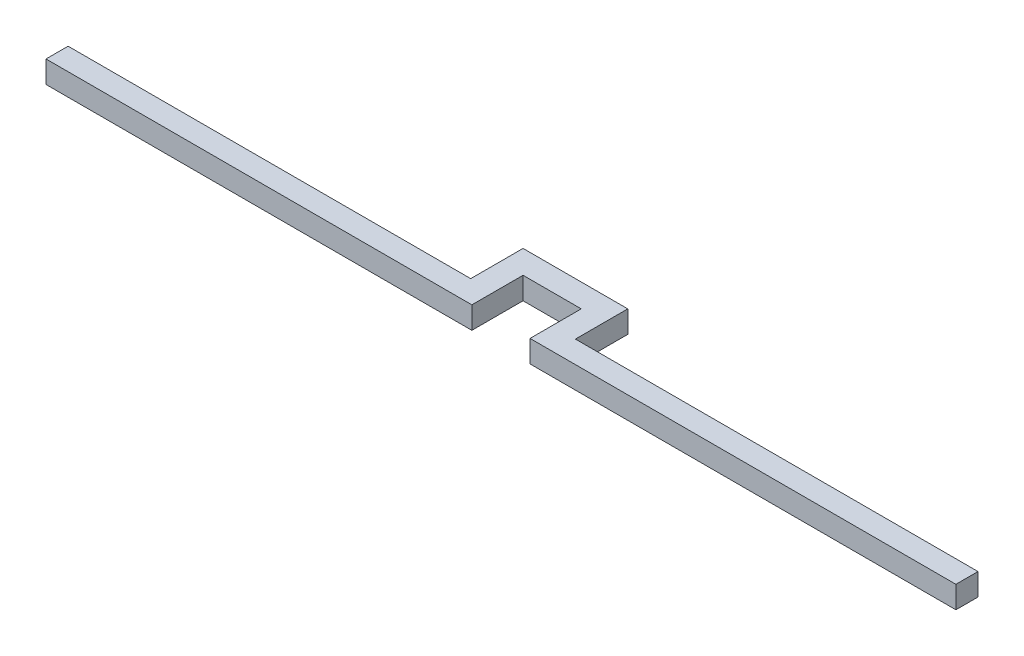
ISO-10303-21;
HEADER;
FILE_DESCRIPTION(('STEP AP214'),'2;1');
FILE_NAME('part.step','',(''),(''),'','','');
FILE_SCHEMA(('AUTOMOTIVE_DESIGN { 1 0 10303 214 1 1 1 1 }'));
ENDSEC;
DATA;
#1=APPLICATION_CONTEXT('core data for automotive mechanical design processes');
#2=APPLICATION_PROTOCOL_DEFINITION('international standard','automotive_design',2000,#1);
#3=PRODUCT_CONTEXT('',#1,'mechanical');
#4=PRODUCT('Part','Part','',(#3));
#5=PRODUCT_RELATED_PRODUCT_CATEGORY('part','',(#4));
#6=PRODUCT_DEFINITION_FORMATION('','',#4);
#7=PRODUCT_DEFINITION_CONTEXT('part definition',#1,'design');
#8=PRODUCT_DEFINITION('design','',#6,#7);
#9=PRODUCT_DEFINITION_SHAPE('','',#8);
#10=(LENGTH_UNIT() NAMED_UNIT(*) SI_UNIT(.MILLI.,.METRE.));
#11=(NAMED_UNIT(*) PLANE_ANGLE_UNIT() SI_UNIT($,.RADIAN.));
#12=(NAMED_UNIT(*) SI_UNIT($,.STERADIAN.) SOLID_ANGLE_UNIT());
#13=UNCERTAINTY_MEASURE_WITH_UNIT(LENGTH_MEASURE(1.E-05),#10,'distance_accuracy_value','');
#14=(GEOMETRIC_REPRESENTATION_CONTEXT(3) GLOBAL_UNCERTAINTY_ASSIGNED_CONTEXT((#13)) GLOBAL_UNIT_ASSIGNED_CONTEXT((#10,
#11,#12)) REPRESENTATION_CONTEXT('',''));
#15=CARTESIAN_POINT('',(0.,0.,0.));
#16=DIRECTION('',(0.,0.,1.));
#17=DIRECTION('',(1.,0.,0.));
#18=AXIS2_PLACEMENT_3D('',#15,#16,#17);
#19=CARTESIAN_POINT('',(2.5,1.9,0.900000000000001));
#20=DIRECTION('',(0.,0.,-1.));
#21=DIRECTION('',(-1.,0.,0.));
#22=AXIS2_PLACEMENT_3D('',#19,#20,#21);
#23=PLANE('',#22);
#24=DIRECTION('',(1.,0.,0.));
#25=VECTOR('',#24,1.);
#26=CARTESIAN_POINT('',(2.5,0.,0.900000000000001));
#27=LINE('',#26,#25);
#28=CARTESIAN_POINT('',(2.5,0.,0.900000000000001));
#29=VERTEX_POINT('',#28);
#30=CARTESIAN_POINT('',(39.1,0.,0.900000000000001));
#31=VERTEX_POINT('',#30);
#32=EDGE_CURVE('E164',#29,#31,#27,.T.);
#33=ORIENTED_EDGE('',*,*,#32,.T.);
#34=DIRECTION('',(0.,-1.,0.));
#35=VECTOR('',#34,1.);
#36=CARTESIAN_POINT('',(39.1,1.9,0.900000000000001));
#37=LINE('',#36,#35);
#38=CARTESIAN_POINT('',(39.1,1.9,0.900000000000001));
#39=VERTEX_POINT('',#38);
#40=EDGE_CURVE('E11',#39,#31,#37,.T.);
#41=ORIENTED_EDGE('',*,*,#40,.F.);
#42=DIRECTION('',(1.,0.,0.));
#43=VECTOR('',#42,1.);
#44=CARTESIAN_POINT('',(2.5,1.9,0.900000000000001));
#45=LINE('',#44,#43);
#46=CARTESIAN_POINT('',(2.5,1.9,0.900000000000001));
#47=VERTEX_POINT('',#46);
#48=EDGE_CURVE('E202',#47,#39,#45,.T.);
#49=ORIENTED_EDGE('',*,*,#48,.F.);
#50=DIRECTION('',(0.,-1.,0.));
#51=VECTOR('',#50,1.);
#52=CARTESIAN_POINT('',(2.5,1.9,0.900000000000001));
#53=LINE('',#52,#51);
#54=EDGE_CURVE('E160',#47,#29,#53,.T.);
#55=ORIENTED_EDGE('',*,*,#54,.T.);
#56=EDGE_LOOP('',(#33,#41,#49,#55));
#57=FACE_BOUND('',#56,.T.);
#58=ADVANCED_FACE('F39',(#57),#23,.F.);
#59=CARTESIAN_POINT('',(39.1,1.9,-0.999999999999999));
#60=DIRECTION('',(-1.,0.,0.));
#61=DIRECTION('',(0.,0.,1.));
#62=AXIS2_PLACEMENT_3D('',#59,#60,#61);
#63=PLANE('',#62);
#64=DIRECTION('',(0.,0.,-1.));
#65=VECTOR('',#64,1.);
#66=CARTESIAN_POINT('',(39.1,0.,-0.999999999999999));
#67=LINE('',#66,#65);
#68=CARTESIAN_POINT('',(39.1,0.,-0.999999999999999));
#69=VERTEX_POINT('',#68);
#70=EDGE_CURVE('E168',#31,#69,#67,.T.);
#71=ORIENTED_EDGE('',*,*,#70,.T.);
#72=DIRECTION('',(0.,-1.,0.));
#73=VECTOR('',#72,1.);
#74=CARTESIAN_POINT('',(39.1,1.9,-0.999999999999999));
#75=LINE('',#74,#73);
#76=CARTESIAN_POINT('',(39.1,1.9,-0.999999999999999));
#77=VERTEX_POINT('',#76);
#78=EDGE_CURVE('E48',#77,#69,#75,.T.);
#79=ORIENTED_EDGE('',*,*,#78,.F.);
#80=DIRECTION('',(0.,0.,-1.));
#81=VECTOR('',#80,1.);
#82=CARTESIAN_POINT('',(39.1,1.9,-0.999999999999999));
#83=LINE('',#82,#81);
#84=EDGE_CURVE('E109',#39,#77,#83,.T.);
#85=ORIENTED_EDGE('',*,*,#84,.F.);
#86=ORIENTED_EDGE('',*,*,#40,.T.);
#87=EDGE_LOOP('',(#71,#79,#85,#86));
#88=FACE_BOUND('',#87,.T.);
#89=ADVANCED_FACE('F288',(#88),#63,.F.);
#90=CARTESIAN_POINT('',(4.5,1.9,-0.999999999999999));
#91=DIRECTION('',(0.,0.,1.));
#92=DIRECTION('',(1.,0.,0.));
#93=AXIS2_PLACEMENT_3D('',#90,#91,#92);
#94=PLANE('',#93);
#95=DIRECTION('',(-1.,0.,0.));
#96=VECTOR('',#95,1.);
#97=CARTESIAN_POINT('',(4.5,0.,-0.999999999999999));
#98=LINE('',#97,#96);
#99=CARTESIAN_POINT('',(4.5,0.,-0.999999999999999));
#100=VERTEX_POINT('',#99);
#101=EDGE_CURVE('E171',#69,#100,#98,.T.);
#102=ORIENTED_EDGE('',*,*,#101,.T.);
#103=DIRECTION('',(0.,-1.,0.));
#104=VECTOR('',#103,1.);
#105=CARTESIAN_POINT('',(4.5,1.9,-0.999999999999999));
#106=LINE('',#105,#104);
#107=CARTESIAN_POINT('',(4.5,1.9,-0.999999999999999));
#108=VERTEX_POINT('',#107);
#109=EDGE_CURVE('E229',#108,#100,#106,.T.);
#110=ORIENTED_EDGE('',*,*,#109,.F.);
#111=DIRECTION('',(-1.,0.,0.));
#112=VECTOR('',#111,1.);
#113=CARTESIAN_POINT('',(4.5,1.9,-0.999999999999999));
#114=LINE('',#113,#112);
#115=EDGE_CURVE('E239',#77,#108,#114,.T.);
#116=ORIENTED_EDGE('',*,*,#115,.F.);
#117=ORIENTED_EDGE('',*,*,#78,.T.);
#118=EDGE_LOOP('',(#102,#110,#116,#117));
#119=FACE_BOUND('',#118,.T.);
#120=ADVANCED_FACE('F237',(#119),#94,.F.);
#121=CARTESIAN_POINT('',(4.5,1.9,-3.5));
#122=DIRECTION('',(-1.,0.,0.));
#123=DIRECTION('',(0.,0.,1.));
#124=AXIS2_PLACEMENT_3D('',#121,#122,#123);
#125=PLANE('',#124);
#126=DIRECTION('',(0.,0.,-1.));
#127=VECTOR('',#126,1.);
#128=CARTESIAN_POINT('',(4.5,0.,-3.5));
#129=LINE('',#128,#127);
#130=CARTESIAN_POINT('',(4.5,0.,-5.5));
#131=VERTEX_POINT('',#130);
#132=EDGE_CURVE('E175',#100,#131,#129,.T.);
#133=ORIENTED_EDGE('',*,*,#132,.T.);
#134=DIRECTION('',(0.,-1.,0.));
#135=VECTOR('',#134,1.);
#136=CARTESIAN_POINT('',(4.5,1.9,-5.5));
#137=LINE('',#136,#135);
#138=CARTESIAN_POINT('',(4.5,1.9,-5.5));
#139=VERTEX_POINT('',#138);
#140=EDGE_CURVE('E225',#139,#131,#137,.T.);
#141=ORIENTED_EDGE('',*,*,#140,.F.);
#142=DIRECTION('',(0.,0.,-1.));
#143=VECTOR('',#142,1.);
#144=CARTESIAN_POINT('',(4.5,1.9,-0.999999999999999));
#145=LINE('',#144,#143);
#146=EDGE_CURVE('E254',#108,#139,#145,.T.);
#147=ORIENTED_EDGE('',*,*,#146,.F.);
#148=ORIENTED_EDGE('',*,*,#109,.T.);
#149=EDGE_LOOP('',(#133,#141,#147,#148));
#150=FACE_BOUND('',#149,.T.);
#151=ADVANCED_FACE('F244',(#150),#125,.F.);
#152=CARTESIAN_POINT('',(4.5,1.9,-5.5));
#153=DIRECTION('',(0.,0.,1.));
#154=DIRECTION('',(1.,0.,0.));
#155=AXIS2_PLACEMENT_3D('',#152,#153,#154);
#156=PLANE('',#155);
#157=DIRECTION('',(-1.,0.,0.));
#158=VECTOR('',#157,1.);
#159=CARTESIAN_POINT('',(4.5,0.,-5.5));
#160=LINE('',#159,#158);
#161=CARTESIAN_POINT('',(-4.5,0.,-5.5));
#162=VERTEX_POINT('',#161);
#163=EDGE_CURVE('E178',#131,#162,#160,.T.);
#164=ORIENTED_EDGE('',*,*,#163,.T.);
#165=DIRECTION('',(0.,-1.,0.));
#166=VECTOR('',#165,1.);
#167=CARTESIAN_POINT('',(-4.5,1.9,-5.5));
#168=LINE('',#167,#166);
#169=CARTESIAN_POINT('',(-4.5,1.9,-5.5));
#170=VERTEX_POINT('',#169);
#171=EDGE_CURVE('E221',#170,#162,#168,.T.);
#172=ORIENTED_EDGE('',*,*,#171,.F.);
#173=DIRECTION('',(-1.,0.,0.));
#174=VECTOR('',#173,1.);
#175=CARTESIAN_POINT('',(4.5,1.9,-5.5));
#176=LINE('',#175,#174);
#177=EDGE_CURVE('E250',#139,#170,#176,.T.);
#178=ORIENTED_EDGE('',*,*,#177,.F.);
#179=ORIENTED_EDGE('',*,*,#140,.T.);
#180=EDGE_LOOP('',(#164,#172,#178,#179));
#181=FACE_BOUND('',#180,.T.);
#182=ADVANCED_FACE('F248',(#181),#156,.F.);
#183=CARTESIAN_POINT('',(-4.5,1.9,-0.999999999999999));
#184=DIRECTION('',(1.,0.,0.));
#185=DIRECTION('',(0.,0.,-1.));
#186=AXIS2_PLACEMENT_3D('',#183,#184,#185);
#187=PLANE('',#186);
#188=DIRECTION('',(0.,0.,1.));
#189=VECTOR('',#188,1.);
#190=CARTESIAN_POINT('',(-4.5,0.,-0.999999999999999));
#191=LINE('',#190,#189);
#192=CARTESIAN_POINT('',(-4.5,0.,-0.999999999999999));
#193=VERTEX_POINT('',#192);
#194=EDGE_CURVE('E182',#162,#193,#191,.T.);
#195=ORIENTED_EDGE('',*,*,#194,.T.);
#196=DIRECTION('',(0.,-1.,0.));
#197=VECTOR('',#196,1.);
#198=CARTESIAN_POINT('',(-4.5,1.9,-0.999999999999999));
#199=LINE('',#198,#197);
#200=CARTESIAN_POINT('',(-4.5,1.9,-0.999999999999999));
#201=VERTEX_POINT('',#200);
#202=EDGE_CURVE('E217',#201,#193,#199,.T.);
#203=ORIENTED_EDGE('',*,*,#202,.F.);
#204=DIRECTION('',(0.,0.,1.));
#205=VECTOR('',#204,1.);
#206=CARTESIAN_POINT('',(-4.5,1.9,-3.5));
#207=LINE('',#206,#205);
#208=EDGE_CURVE('E253',#170,#201,#207,.T.);
#209=ORIENTED_EDGE('',*,*,#208,.F.);
#210=ORIENTED_EDGE('',*,*,#171,.T.);
#211=EDGE_LOOP('',(#195,#203,#209,#210));
#212=FACE_BOUND('',#211,.T.);
#213=ADVANCED_FACE('F300',(#212),#187,.F.);
#214=CARTESIAN_POINT('',(-39.1,1.9,-0.999999999999999));
#215=DIRECTION('',(0.,0.,1.));
#216=DIRECTION('',(1.,0.,0.));
#217=AXIS2_PLACEMENT_3D('',#214,#215,#216);
#218=PLANE('',#217);
#219=DIRECTION('',(-1.,0.,0.));
#220=VECTOR('',#219,1.);
#221=CARTESIAN_POINT('',(-39.1,0.,-0.999999999999999));
#222=LINE('',#221,#220);
#223=CARTESIAN_POINT('',(-39.1,0.,-0.999999999999999));
#224=VERTEX_POINT('',#223);
#225=EDGE_CURVE('E185',#193,#224,#222,.T.);
#226=ORIENTED_EDGE('',*,*,#225,.T.);
#227=DIRECTION('',(0.,-1.,0.));
#228=VECTOR('',#227,1.);
#229=CARTESIAN_POINT('',(-39.1,1.9,-0.999999999999999));
#230=LINE('',#229,#228);
#231=CARTESIAN_POINT('',(-39.1,1.9,-0.999999999999999));
#232=VERTEX_POINT('',#231);
#233=EDGE_CURVE('E213',#232,#224,#230,.T.);
#234=ORIENTED_EDGE('',*,*,#233,.F.);
#235=DIRECTION('',(-1.,0.,0.));
#236=VECTOR('',#235,1.);
#237=CARTESIAN_POINT('',(-39.1,1.9,-0.999999999999999));
#238=LINE('',#237,#236);
#239=EDGE_CURVE('E258',#201,#232,#238,.T.);
#240=ORIENTED_EDGE('',*,*,#239,.F.);
#241=ORIENTED_EDGE('',*,*,#202,.T.);
#242=EDGE_LOOP('',(#226,#234,#240,#241));
#243=FACE_BOUND('',#242,.T.);
#244=ADVANCED_FACE('F303',(#243),#218,.F.);
#245=CARTESIAN_POINT('',(-39.1,1.9,-0.999999999999999));
#246=DIRECTION('',(1.,0.,0.));
#247=DIRECTION('',(0.,0.,-1.));
#248=AXIS2_PLACEMENT_3D('',#245,#246,#247);
#249=PLANE('',#248);
#250=DIRECTION('',(0.,0.,1.));
#251=VECTOR('',#250,1.);
#252=CARTESIAN_POINT('',(-39.1,0.,-0.999999999999999));
#253=LINE('',#252,#251);
#254=CARTESIAN_POINT('',(-39.1,0.,0.900000000000001));
#255=VERTEX_POINT('',#254);
#256=EDGE_CURVE('E188',#224,#255,#253,.T.);
#257=ORIENTED_EDGE('',*,*,#256,.T.);
#258=DIRECTION('',(0.,-1.,0.));
#259=VECTOR('',#258,1.);
#260=CARTESIAN_POINT('',(-39.1,1.9,0.900000000000001));
#261=LINE('',#260,#259);
#262=CARTESIAN_POINT('',(-39.1,1.9,0.900000000000001));
#263=VERTEX_POINT('',#262);
#264=EDGE_CURVE('E209',#263,#255,#261,.T.);
#265=ORIENTED_EDGE('',*,*,#264,.F.);
#266=DIRECTION('',(0.,0.,1.));
#267=VECTOR('',#266,1.);
#268=CARTESIAN_POINT('',(-39.1,1.9,-0.999999999999999));
#269=LINE('',#268,#267);
#270=EDGE_CURVE('E265',#232,#263,#269,.T.);
#271=ORIENTED_EDGE('',*,*,#270,.F.);
#272=ORIENTED_EDGE('',*,*,#233,.T.);
#273=EDGE_LOOP('',(#257,#265,#271,#272));
#274=FACE_BOUND('',#273,.T.);
#275=ADVANCED_FACE('F273',(#274),#249,.F.);
#276=CARTESIAN_POINT('',(-39.1,1.9,0.900000000000001));
#277=DIRECTION('',(0.,0.,-1.));
#278=DIRECTION('',(-1.,0.,0.));
#279=AXIS2_PLACEMENT_3D('',#276,#277,#278);
#280=PLANE('',#279);
#281=DIRECTION('',(1.,0.,0.));
#282=VECTOR('',#281,1.);
#283=CARTESIAN_POINT('',(-39.1,0.,0.900000000000001));
#284=LINE('',#283,#282);
#285=CARTESIAN_POINT('',(-2.5,0.,0.900000000000001));
#286=VERTEX_POINT('',#285);
#287=EDGE_CURVE('E191',#255,#286,#284,.T.);
#288=ORIENTED_EDGE('',*,*,#287,.T.);
#289=DIRECTION('',(0.,-1.,0.));
#290=VECTOR('',#289,1.);
#291=CARTESIAN_POINT('',(-2.5,1.9,0.900000000000001));
#292=LINE('',#291,#290);
#293=CARTESIAN_POINT('',(-2.5,1.9,0.900000000000001));
#294=VERTEX_POINT('',#293);
#295=EDGE_CURVE('E153',#294,#286,#292,.T.);
#296=ORIENTED_EDGE('',*,*,#295,.F.);
#297=DIRECTION('',(1.,0.,0.));
#298=VECTOR('',#297,1.);
#299=CARTESIAN_POINT('',(-39.1,1.9,0.900000000000001));
#300=LINE('',#299,#298);
#301=EDGE_CURVE('E141',#263,#294,#300,.T.);
#302=ORIENTED_EDGE('',*,*,#301,.F.);
#303=ORIENTED_EDGE('',*,*,#264,.T.);
#304=EDGE_LOOP('',(#288,#296,#302,#303));
#305=FACE_BOUND('',#304,.T.);
#306=ADVANCED_FACE('F277',(#305),#280,.F.);
#307=CARTESIAN_POINT('',(-2.5,1.9,-0.999999999999999));
#308=DIRECTION('',(-1.,0.,0.));
#309=DIRECTION('',(0.,0.,1.));
#310=AXIS2_PLACEMENT_3D('',#307,#308,#309);
#311=PLANE('',#310);
#312=DIRECTION('',(0.,0.,-1.));
#313=VECTOR('',#312,1.);
#314=CARTESIAN_POINT('',(-2.5,0.,-0.999999999999999));
#315=LINE('',#314,#313);
#316=CARTESIAN_POINT('',(-2.5,0.,-3.5));
#317=VERTEX_POINT('',#316);
#318=EDGE_CURVE('E150',#286,#317,#315,.T.);
#319=ORIENTED_EDGE('',*,*,#318,.T.);
#320=DIRECTION('',(0.,-1.,0.));
#321=VECTOR('',#320,1.);
#322=CARTESIAN_POINT('',(-2.5,1.9,-3.5));
#323=LINE('',#322,#321);
#324=CARTESIAN_POINT('',(-2.5,1.9,-3.5));
#325=VERTEX_POINT('',#324);
#326=EDGE_CURVE('E148',#325,#317,#323,.T.);
#327=ORIENTED_EDGE('',*,*,#326,.F.);
#328=DIRECTION('',(0.,0.,-1.));
#329=VECTOR('',#328,1.);
#330=CARTESIAN_POINT('',(-2.5,1.9,-0.999999999999999));
#331=LINE('',#330,#329);
#332=EDGE_CURVE('E134',#294,#325,#331,.T.);
#333=ORIENTED_EDGE('',*,*,#332,.F.);
#334=ORIENTED_EDGE('',*,*,#295,.T.);
#335=EDGE_LOOP('',(#319,#327,#333,#334));
#336=FACE_BOUND('',#335,.T.);
#337=ADVANCED_FACE('F149',(#336),#311,.F.);
#338=CARTESIAN_POINT('',(2.5,1.9,-3.5));
#339=DIRECTION('',(0.,0.,-1.));
#340=DIRECTION('',(-1.,0.,0.));
#341=AXIS2_PLACEMENT_3D('',#338,#339,#340);
#342=PLANE('',#341);
#343=DIRECTION('',(1.,0.,0.));
#344=VECTOR('',#343,1.);
#345=CARTESIAN_POINT('',(2.5,0.,-3.5));
#346=LINE('',#345,#344);
#347=CARTESIAN_POINT('',(2.5,0.,-3.5));
#348=VERTEX_POINT('',#347);
#349=EDGE_CURVE('E197',#317,#348,#346,.T.);
#350=ORIENTED_EDGE('',*,*,#349,.T.);
#351=DIRECTION('',(0.,-1.,0.));
#352=VECTOR('',#351,1.);
#353=CARTESIAN_POINT('',(2.5,1.9,-3.5));
#354=LINE('',#353,#352);
#355=CARTESIAN_POINT('',(2.5,1.9,-3.5));
#356=VERTEX_POINT('',#355);
#357=EDGE_CURVE('E154',#356,#348,#354,.T.);
#358=ORIENTED_EDGE('',*,*,#357,.F.);
#359=DIRECTION('',(1.,0.,0.));
#360=VECTOR('',#359,1.);
#361=CARTESIAN_POINT('',(2.5,1.9,-3.5));
#362=LINE('',#361,#360);
#363=EDGE_CURVE('E138',#325,#356,#362,.T.);
#364=ORIENTED_EDGE('',*,*,#363,.F.);
#365=ORIENTED_EDGE('',*,*,#326,.T.);
#366=EDGE_LOOP('',(#350,#358,#364,#365));
#367=FACE_BOUND('',#366,.T.);
#368=ADVANCED_FACE('F156',(#367),#342,.F.);
#369=CARTESIAN_POINT('',(2.5,1.9,-0.999999999999999));
#370=DIRECTION('',(1.,0.,0.));
#371=DIRECTION('',(0.,0.,-1.));
#372=AXIS2_PLACEMENT_3D('',#369,#370,#371);
#373=PLANE('',#372);
#374=DIRECTION('',(0.,0.,1.));
#375=VECTOR('',#374,1.);
#376=CARTESIAN_POINT('',(2.5,0.,-0.999999999999999));
#377=LINE('',#376,#375);
#378=EDGE_CURVE('E97',#348,#29,#377,.T.);
#379=ORIENTED_EDGE('',*,*,#378,.T.);
#380=ORIENTED_EDGE('',*,*,#54,.F.);
#381=DIRECTION('',(0.,0.,1.));
#382=VECTOR('',#381,1.);
#383=CARTESIAN_POINT('',(2.5,1.9,-0.999999999999999));
#384=LINE('',#383,#382);
#385=EDGE_CURVE('E56',#356,#47,#384,.T.);
#386=ORIENTED_EDGE('',*,*,#385,.F.);
#387=ORIENTED_EDGE('',*,*,#357,.T.);
#388=EDGE_LOOP('',(#379,#380,#386,#387));
#389=FACE_BOUND('',#388,.T.);
#390=ADVANCED_FACE('F279',(#389),#373,.F.);
#391=CARTESIAN_POINT('',(0.,1.9,0.));
#392=DIRECTION('',(0.,-1.,0.));
#393=DIRECTION('',(0.,0.,-1.));
#394=AXIS2_PLACEMENT_3D('',#391,#392,#393);
#395=PLANE('',#394);
#396=ORIENTED_EDGE('',*,*,#48,.T.);
#397=ORIENTED_EDGE('',*,*,#84,.T.);
#398=ORIENTED_EDGE('',*,*,#115,.T.);
#399=ORIENTED_EDGE('',*,*,#146,.T.);
#400=ORIENTED_EDGE('',*,*,#177,.T.);
#401=ORIENTED_EDGE('',*,*,#208,.T.);
#402=ORIENTED_EDGE('',*,*,#239,.T.);
#403=ORIENTED_EDGE('',*,*,#270,.T.);
#404=ORIENTED_EDGE('',*,*,#301,.T.);
#405=ORIENTED_EDGE('',*,*,#332,.T.);
#406=ORIENTED_EDGE('',*,*,#363,.T.);
#407=ORIENTED_EDGE('',*,*,#385,.T.);
#408=EDGE_LOOP('',(#396,#397,#398,#399,#400,#401,#402,#403,#404,#405,#406,#407));
#409=FACE_BOUND('',#408,.T.);
#410=ADVANCED_FACE('F136',(#409),#395,.F.);
#411=CARTESIAN_POINT('',(0.,0.,0.));
#412=DIRECTION('',(0.,-1.,0.));
#413=DIRECTION('',(0.,0.,-1.));
#414=AXIS2_PLACEMENT_3D('',#411,#412,#413);
#415=PLANE('',#414);
#416=ORIENTED_EDGE('',*,*,#32,.F.);
#417=ORIENTED_EDGE('',*,*,#378,.F.);
#418=ORIENTED_EDGE('',*,*,#349,.F.);
#419=ORIENTED_EDGE('',*,*,#318,.F.);
#420=ORIENTED_EDGE('',*,*,#287,.F.);
#421=ORIENTED_EDGE('',*,*,#256,.F.);
#422=ORIENTED_EDGE('',*,*,#225,.F.);
#423=ORIENTED_EDGE('',*,*,#194,.F.);
#424=ORIENTED_EDGE('',*,*,#163,.F.);
#425=ORIENTED_EDGE('',*,*,#132,.F.);
#426=ORIENTED_EDGE('',*,*,#101,.F.);
#427=ORIENTED_EDGE('',*,*,#70,.F.);
#428=EDGE_LOOP('',(#416,#417,#418,#419,#420,#421,#422,#423,#424,#425,#426,#427));
#429=FACE_BOUND('',#428,.T.);
#430=ADVANCED_FACE('F240',(#429),#415,.T.);
#431=CLOSED_SHELL('',(#58,#89,#120,#151,#182,#213,#244,#275,#306,#337,#368,#390,#410,#430));
#432=MANIFOLD_SOLID_BREP('B2',#431);
#433=ADVANCED_BREP_SHAPE_REPRESENTATION('',(#18,#432),#14);
#434=SHAPE_DEFINITION_REPRESENTATION(#9,#433);
ENDSEC;
END-ISO-10303-21;
